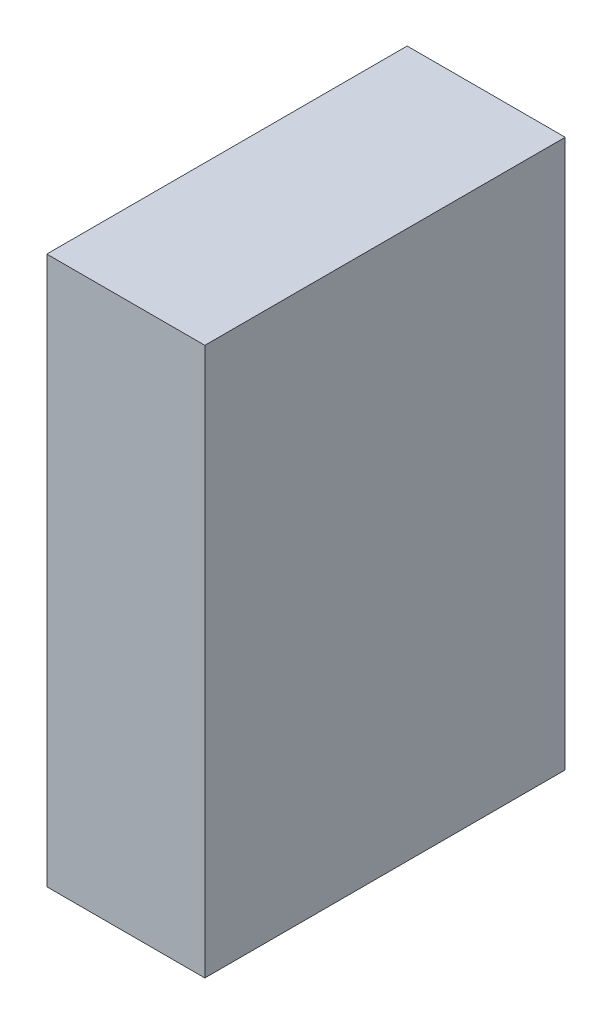
ISO-10303-21;
HEADER;
FILE_DESCRIPTION(('STEP AP214'),'2;1');
FILE_NAME('part.step','',(''),(''),'','','');
FILE_SCHEMA(('AUTOMOTIVE_DESIGN { 1 0 10303 214 1 1 1 1 }'));
ENDSEC;
DATA;
#1=APPLICATION_CONTEXT('core data for automotive mechanical design processes');
#2=APPLICATION_PROTOCOL_DEFINITION('international standard','automotive_design',2000,#1);
#3=PRODUCT_CONTEXT('',#1,'mechanical');
#4=PRODUCT('Part','Part','',(#3));
#5=PRODUCT_RELATED_PRODUCT_CATEGORY('part','',(#4));
#6=PRODUCT_DEFINITION_FORMATION('','',#4);
#7=PRODUCT_DEFINITION_CONTEXT('part definition',#1,'design');
#8=PRODUCT_DEFINITION('design','',#6,#7);
#9=PRODUCT_DEFINITION_SHAPE('','',#8);
#10=(LENGTH_UNIT() NAMED_UNIT(*) SI_UNIT(.MILLI.,.METRE.));
#11=(NAMED_UNIT(*) PLANE_ANGLE_UNIT() SI_UNIT($,.RADIAN.));
#12=(NAMED_UNIT(*) SI_UNIT($,.STERADIAN.) SOLID_ANGLE_UNIT());
#13=UNCERTAINTY_MEASURE_WITH_UNIT(LENGTH_MEASURE(1.E-05),#10,'distance_accuracy_value','');
#14=(GEOMETRIC_REPRESENTATION_CONTEXT(3) GLOBAL_UNCERTAINTY_ASSIGNED_CONTEXT((#13)) GLOBAL_UNIT_ASSIGNED_CONTEXT((#10,
#11,#12)) REPRESENTATION_CONTEXT('',''));
#15=CARTESIAN_POINT('',(0.,0.,0.));
#16=DIRECTION('',(0.,0.,1.));
#17=DIRECTION('',(1.,0.,0.));
#18=AXIS2_PLACEMENT_3D('',#15,#16,#17);
#19=CARTESIAN_POINT('',(0.18750026,0.65000124,0.));
#20=DIRECTION('',(1.,0.,0.));
#21=DIRECTION('',(0.,0.,-1.));
#22=AXIS2_PLACEMENT_3D('',#19,#20,#21);
#23=PLANE('',#22);
#24=DIRECTION('',(0.,0.,-1.));
#25=VECTOR('',#24,1.);
#26=CARTESIAN_POINT('',(0.18750026,-0.65000124,0.));
#27=LINE('',#26,#25);
#28=CARTESIAN_POINT('',(0.18750026,-0.65000124,0.));
#29=VERTEX_POINT('',#28);
#30=CARTESIAN_POINT('',(0.18750026,-0.65000124,0.855));
#31=VERTEX_POINT('',#30);
#32=EDGE_CURVE('E20',#29,#31,#27,.F.);
#33=ORIENTED_EDGE('',*,*,#32,.F.);
#34=DIRECTION('',(0.,1.,0.));
#35=VECTOR('',#34,1.);
#36=CARTESIAN_POINT('',(0.18750026,-0.65000124,0.));
#37=LINE('',#36,#35);
#38=CARTESIAN_POINT('',(0.18750026,0.65000124,0.));
#39=VERTEX_POINT('',#38);
#40=EDGE_CURVE('E80',#29,#39,#37,.T.);
#41=ORIENTED_EDGE('',*,*,#40,.T.);
#42=DIRECTION('',(0.,0.,1.));
#43=VECTOR('',#42,1.);
#44=CARTESIAN_POINT('',(0.18750026,0.65000124,0.));
#45=LINE('',#44,#43);
#46=CARTESIAN_POINT('',(0.18750026,0.65000124,0.855));
#47=VERTEX_POINT('',#46);
#48=EDGE_CURVE('E68',#47,#39,#45,.F.);
#49=ORIENTED_EDGE('',*,*,#48,.F.);
#50=DIRECTION('',(0.,1.,0.));
#51=VECTOR('',#50,1.);
#52=CARTESIAN_POINT('',(0.18750026,-0.65000124,0.855));
#53=LINE('',#52,#51);
#54=EDGE_CURVE('E56',#31,#47,#53,.T.);
#55=ORIENTED_EDGE('',*,*,#54,.F.);
#56=EDGE_LOOP('',(#33,#41,#49,#55));
#57=FACE_BOUND('',#56,.T.);
#58=ADVANCED_FACE('F17',(#57),#23,.T.);
#59=CARTESIAN_POINT('',(0.18750026,-0.65000124,0.));
#60=DIRECTION('',(0.,-1.,0.));
#61=DIRECTION('',(0.,0.,-1.));
#62=AXIS2_PLACEMENT_3D('',#59,#60,#61);
#63=PLANE('',#62);
#64=DIRECTION('',(0.,0.,1.));
#65=VECTOR('',#64,1.);
#66=CARTESIAN_POINT('',(-0.18750026,-0.65000124,0.));
#67=LINE('',#66,#65);
#68=CARTESIAN_POINT('',(-0.18750026,-0.65000124,0.));
#69=VERTEX_POINT('',#68);
#70=CARTESIAN_POINT('',(-0.18750026,-0.65000124,0.855));
#71=VERTEX_POINT('',#70);
#72=EDGE_CURVE('E83',#69,#71,#67,.T.);
#73=ORIENTED_EDGE('',*,*,#72,.F.);
#74=DIRECTION('',(1.,0.,0.));
#75=VECTOR('',#74,1.);
#76=CARTESIAN_POINT('',(-0.18750026,-0.65000124,0.));
#77=LINE('',#76,#75);
#78=EDGE_CURVE('E65',#69,#29,#77,.T.);
#79=ORIENTED_EDGE('',*,*,#78,.T.);
#80=ORIENTED_EDGE('',*,*,#32,.T.);
#81=DIRECTION('',(1.,0.,0.));
#82=VECTOR('',#81,1.);
#83=CARTESIAN_POINT('',(-0.18750026,-0.65000124,0.855));
#84=LINE('',#83,#82);
#85=EDGE_CURVE('E62',#71,#31,#84,.T.);
#86=ORIENTED_EDGE('',*,*,#85,.F.);
#87=EDGE_LOOP('',(#73,#79,#80,#86));
#88=FACE_BOUND('',#87,.T.);
#89=ADVANCED_FACE('F61',(#88),#63,.T.);
#90=CARTESIAN_POINT('',(-0.18750026,-0.65000124,0.855));
#91=DIRECTION('',(0.,0.,1.));
#92=DIRECTION('',(1.,0.,0.));
#93=AXIS2_PLACEMENT_3D('',#90,#91,#92);
#94=PLANE('',#93);
#95=DIRECTION('',(1.,0.,0.));
#96=VECTOR('',#95,1.);
#97=CARTESIAN_POINT('',(-0.18750026,0.65000124,0.855));
#98=LINE('',#97,#96);
#99=CARTESIAN_POINT('',(-0.18750026,0.65000124,0.855));
#100=VERTEX_POINT('',#99);
#101=EDGE_CURVE('E70',#100,#47,#98,.T.);
#102=ORIENTED_EDGE('',*,*,#101,.F.);
#103=DIRECTION('',(0.,1.,0.));
#104=VECTOR('',#103,1.);
#105=CARTESIAN_POINT('',(-0.18750026,-0.65000124,0.855));
#106=LINE('',#105,#104);
#107=EDGE_CURVE('E74',#71,#100,#106,.T.);
#108=ORIENTED_EDGE('',*,*,#107,.F.);
#109=ORIENTED_EDGE('',*,*,#85,.T.);
#110=ORIENTED_EDGE('',*,*,#54,.T.);
#111=EDGE_LOOP('',(#102,#108,#109,#110));
#112=FACE_BOUND('',#111,.T.);
#113=ADVANCED_FACE('F72',(#112),#94,.T.);
#114=CARTESIAN_POINT('',(-0.18750026,0.65000124,0.));
#115=DIRECTION('',(0.,1.,0.));
#116=DIRECTION('',(0.,0.,1.));
#117=AXIS2_PLACEMENT_3D('',#114,#115,#116);
#118=PLANE('',#117);
#119=ORIENTED_EDGE('',*,*,#48,.T.);
#120=DIRECTION('',(1.,0.,0.));
#121=VECTOR('',#120,1.);
#122=CARTESIAN_POINT('',(-0.18750026,0.65000124,0.));
#123=LINE('',#122,#121);
#124=CARTESIAN_POINT('',(-0.18750026,0.65000124,0.));
#125=VERTEX_POINT('',#124);
#126=EDGE_CURVE('E35',#39,#125,#123,.F.);
#127=ORIENTED_EDGE('',*,*,#126,.T.);
#128=DIRECTION('',(0.,0.,1.));
#129=VECTOR('',#128,1.);
#130=CARTESIAN_POINT('',(-0.18750026,0.65000124,0.));
#131=LINE('',#130,#129);
#132=EDGE_CURVE('E26',#100,#125,#131,.F.);
#133=ORIENTED_EDGE('',*,*,#132,.F.);
#134=ORIENTED_EDGE('',*,*,#101,.T.);
#135=EDGE_LOOP('',(#119,#127,#133,#134));
#136=FACE_BOUND('',#135,.T.);
#137=ADVANCED_FACE('F89',(#136),#118,.T.);
#138=CARTESIAN_POINT('',(-0.18750026,-0.65000124,0.));
#139=DIRECTION('',(0.,0.,1.));
#140=DIRECTION('',(1.,0.,0.));
#141=AXIS2_PLACEMENT_3D('',#138,#139,#140);
#142=PLANE('',#141);
#143=ORIENTED_EDGE('',*,*,#126,.F.);
#144=ORIENTED_EDGE('',*,*,#40,.F.);
#145=ORIENTED_EDGE('',*,*,#78,.F.);
#146=DIRECTION('',(0.,1.,0.));
#147=VECTOR('',#146,1.);
#148=CARTESIAN_POINT('',(-0.18750026,-0.65000124,0.));
#149=LINE('',#148,#147);
#150=EDGE_CURVE('E11',#125,#69,#149,.F.);
#151=ORIENTED_EDGE('',*,*,#150,.F.);
#152=EDGE_LOOP('',(#143,#144,#145,#151));
#153=FACE_BOUND('',#152,.T.);
#154=ADVANCED_FACE('F91',(#153),#142,.F.);
#155=CARTESIAN_POINT('',(-0.18750026,-0.65000124,0.));
#156=DIRECTION('',(-1.,0.,0.));
#157=DIRECTION('',(0.,0.,1.));
#158=AXIS2_PLACEMENT_3D('',#155,#156,#157);
#159=PLANE('',#158);
#160=ORIENTED_EDGE('',*,*,#132,.T.);
#161=ORIENTED_EDGE('',*,*,#150,.T.);
#162=ORIENTED_EDGE('',*,*,#72,.T.);
#163=ORIENTED_EDGE('',*,*,#107,.T.);
#164=EDGE_LOOP('',(#160,#161,#162,#163));
#165=FACE_BOUND('',#164,.T.);
#166=ADVANCED_FACE('F88',(#165),#159,.T.);
#167=CLOSED_SHELL('',(#58,#89,#113,#137,#154,#166));
#168=MANIFOLD_SOLID_BREP('B1',#167);
#169=ADVANCED_BREP_SHAPE_REPRESENTATION('',(#18,#168),#14);
#170=SHAPE_DEFINITION_REPRESENTATION(#9,#169);
ENDSEC;
END-ISO-10303-21;
